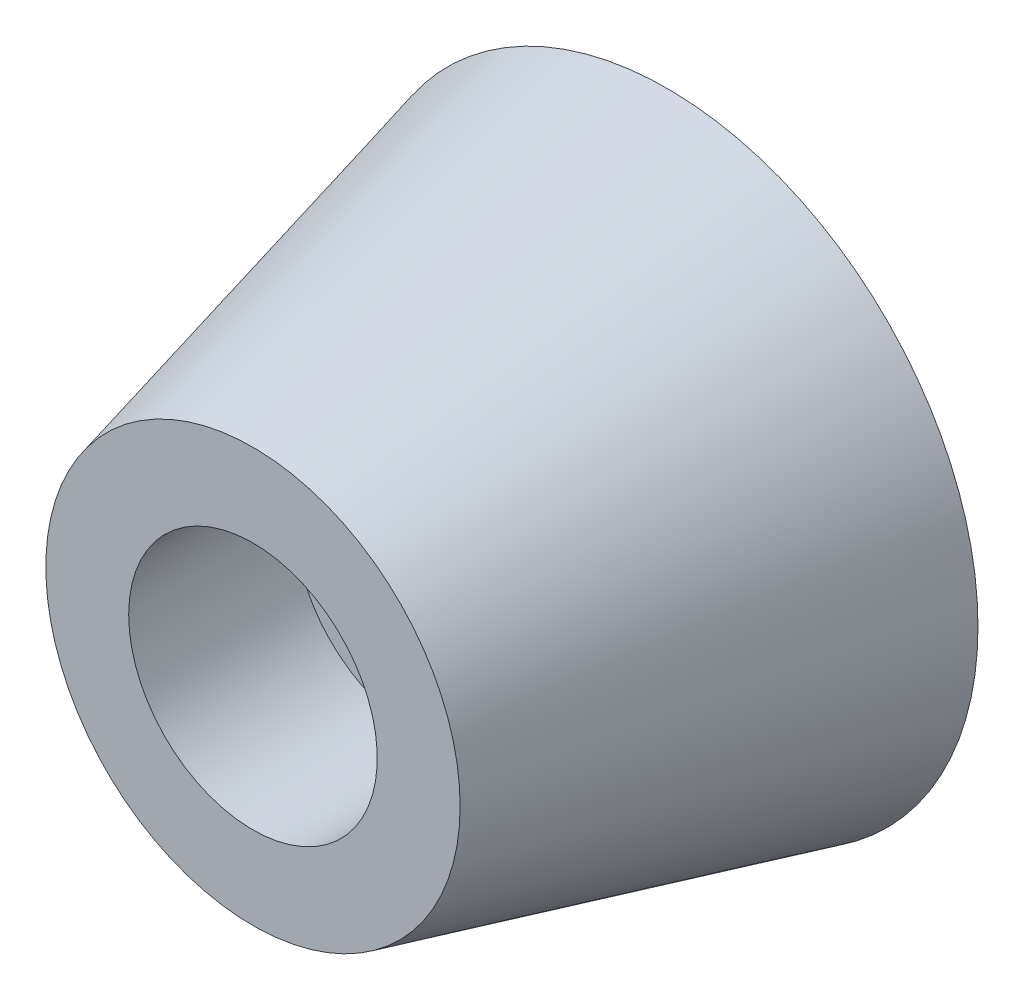
ISO-10303-21;
HEADER;
FILE_DESCRIPTION(('STEP AP214'),'2;1');
FILE_NAME('part.step','',(''),(''),'','','');
FILE_SCHEMA(('AUTOMOTIVE_DESIGN { 1 0 10303 214 1 1 1 1 }'));
ENDSEC;
DATA;
#1=APPLICATION_CONTEXT('core data for automotive mechanical design processes');
#2=APPLICATION_PROTOCOL_DEFINITION('international standard','automotive_design',2000,#1);
#3=PRODUCT_CONTEXT('',#1,'mechanical');
#4=PRODUCT('Part','Part','',(#3));
#5=PRODUCT_RELATED_PRODUCT_CATEGORY('part','',(#4));
#6=PRODUCT_DEFINITION_FORMATION('','',#4);
#7=PRODUCT_DEFINITION_CONTEXT('part definition',#1,'design');
#8=PRODUCT_DEFINITION('design','',#6,#7);
#9=PRODUCT_DEFINITION_SHAPE('','',#8);
#10=(LENGTH_UNIT() NAMED_UNIT(*) SI_UNIT(.MILLI.,.METRE.));
#11=(NAMED_UNIT(*) PLANE_ANGLE_UNIT() SI_UNIT($,.RADIAN.));
#12=(NAMED_UNIT(*) SI_UNIT($,.STERADIAN.) SOLID_ANGLE_UNIT());
#13=UNCERTAINTY_MEASURE_WITH_UNIT(LENGTH_MEASURE(1.E-05),#10,'distance_accuracy_value','');
#14=(GEOMETRIC_REPRESENTATION_CONTEXT(3) GLOBAL_UNCERTAINTY_ASSIGNED_CONTEXT((#13)) GLOBAL_UNIT_ASSIGNED_CONTEXT((#10,
#11,#12)) REPRESENTATION_CONTEXT('',''));
#15=CARTESIAN_POINT('',(0.,0.,0.));
#16=DIRECTION('',(0.,0.,1.));
#17=DIRECTION('',(1.,0.,0.));
#18=AXIS2_PLACEMENT_3D('',#15,#16,#17);
#19=CARTESIAN_POINT('',(0.,0.,10.));
#20=DIRECTION('',(0.,0.,1.));
#21=DIRECTION('',(1.,0.,0.));
#22=AXIS2_PLACEMENT_3D('',#19,#20,#21);
#23=PLANE('',#22);
#24=CARTESIAN_POINT('',(0.,0.,10.));
#25=DIRECTION('',(0.,0.,-1.));
#26=DIRECTION('',(-1.,0.,0.));
#27=AXIS2_PLACEMENT_3D('',#24,#25,#26);
#28=CIRCLE('',#27,3.);
#29=CARTESIAN_POINT('',(-3.,0.,10.));
#30=VERTEX_POINT('',#29);
#31=EDGE_CURVE('E109',#30,#30,#28,.T.);
#32=ORIENTED_EDGE('',*,*,#31,.T.);
#33=EDGE_LOOP('',(#32));
#34=FACE_BOUND('',#33,.T.);
#35=CARTESIAN_POINT('',(0.,0.,10.));
#36=DIRECTION('',(0.,0.,1.));
#37=DIRECTION('',(1.,0.,0.));
#38=AXIS2_PLACEMENT_3D('',#35,#36,#37);
#39=CIRCLE('',#38,5.);
#40=CARTESIAN_POINT('',(5.,0.,10.));
#41=VERTEX_POINT('',#40);
#42=EDGE_CURVE('E11',#41,#41,#39,.T.);
#43=ORIENTED_EDGE('',*,*,#42,.T.);
#44=EDGE_LOOP('',(#43));
#45=FACE_BOUND('',#44,.T.);
#46=ADVANCED_FACE('F39',(#34,#45),#23,.T.);
#47=CARTESIAN_POINT('',(0.,0.,0.));
#48=DIRECTION('',(0.,0.,1.));
#49=DIRECTION('',(1.,0.,0.));
#50=AXIS2_PLACEMENT_3D('',#47,#48,#49);
#51=PLANE('',#50);
#52=CARTESIAN_POINT('',(0.,0.,0.));
#53=DIRECTION('',(0.,0.,1.));
#54=DIRECTION('',(1.,0.,0.));
#55=AXIS2_PLACEMENT_3D('',#52,#53,#54);
#56=CIRCLE('',#55,1.75);
#57=CARTESIAN_POINT('',(1.75,0.,0.));
#58=VERTEX_POINT('',#57);
#59=EDGE_CURVE('E43',#58,#58,#56,.T.);
#60=ORIENTED_EDGE('',*,*,#59,.T.);
#61=EDGE_LOOP('',(#60));
#62=FACE_BOUND('',#61,.T.);
#63=CARTESIAN_POINT('',(0.,0.,0.));
#64=DIRECTION('',(0.,0.,1.));
#65=DIRECTION('',(1.,0.,0.));
#66=AXIS2_PLACEMENT_3D('',#63,#64,#65);
#67=CIRCLE('',#66,7.49855076872682);
#68=CARTESIAN_POINT('',(7.49855076872682,0.,0.));
#69=VERTEX_POINT('',#68);
#70=EDGE_CURVE('E47',#69,#69,#67,.T.);
#71=ORIENTED_EDGE('',*,*,#70,.F.);
#72=EDGE_LOOP('',(#71));
#73=FACE_BOUND('',#72,.T.);
#74=ADVANCED_FACE('F73',(#62,#73),#51,.F.);
#75=CARTESIAN_POINT('',(0.,0.,10.));
#76=DIRECTION('',(0.,0.,-1.));
#77=DIRECTION('',(-1.,0.,0.));
#78=AXIS2_PLACEMENT_3D('',#75,#76,#77);
#79=CONICAL_SURFACE('',#78,5.,0.244842260238956);
#80=ORIENTED_EDGE('',*,*,#70,.T.);
#81=EDGE_LOOP('',(#80));
#82=FACE_BOUND('',#81,.T.);
#83=ORIENTED_EDGE('',*,*,#42,.F.);
#84=EDGE_LOOP('',(#83));
#85=FACE_BOUND('',#84,.T.);
#86=ADVANCED_FACE('F82',(#82,#85),#79,.T.);
#87=CARTESIAN_POINT('',(0.,0.,6.));
#88=DIRECTION('',(0.,0.,1.));
#89=DIRECTION('',(1.,0.,0.));
#90=AXIS2_PLACEMENT_3D('',#87,#88,#89);
#91=CYLINDRICAL_SURFACE('',#90,3.);
#92=CARTESIAN_POINT('',(0.,0.,6.));
#93=DIRECTION('',(0.,0.,-1.));
#94=DIRECTION('',(-1.,0.,0.));
#95=AXIS2_PLACEMENT_3D('',#92,#93,#94);
#96=CIRCLE('',#95,3.);
#97=CARTESIAN_POINT('',(-3.,0.,6.));
#98=VERTEX_POINT('',#97);
#99=EDGE_CURVE('E53',#98,#98,#96,.T.);
#100=ORIENTED_EDGE('',*,*,#99,.T.);
#101=EDGE_LOOP('',(#100));
#102=FACE_BOUND('',#101,.T.);
#103=ORIENTED_EDGE('',*,*,#31,.F.);
#104=EDGE_LOOP('',(#103));
#105=FACE_BOUND('',#104,.T.);
#106=ADVANCED_FACE('F84',(#102,#105),#91,.F.);
#107=CARTESIAN_POINT('',(0.,0.,6.));
#108=DIRECTION('',(0.,0.,-1.));
#109=DIRECTION('',(-1.,0.,0.));
#110=AXIS2_PLACEMENT_3D('',#107,#108,#109);
#111=PLANE('',#110);
#112=CARTESIAN_POINT('',(0.,0.,6.));
#113=DIRECTION('',(0.,0.,1.));
#114=DIRECTION('',(1.,0.,0.));
#115=AXIS2_PLACEMENT_3D('',#112,#113,#114);
#116=CIRCLE('',#115,1.75);
#117=CARTESIAN_POINT('',(1.75,0.,6.));
#118=VERTEX_POINT('',#117);
#119=EDGE_CURVE('E114',#118,#118,#116,.T.);
#120=ORIENTED_EDGE('',*,*,#119,.F.);
#121=EDGE_LOOP('',(#120));
#122=FACE_BOUND('',#121,.T.);
#123=ORIENTED_EDGE('',*,*,#99,.F.);
#124=EDGE_LOOP('',(#123));
#125=FACE_BOUND('',#124,.T.);
#126=ADVANCED_FACE('F124',(#122,#125),#111,.F.);
#127=CARTESIAN_POINT('',(0.,0.,-4.));
#128=DIRECTION('',(0.,0.,1.));
#129=DIRECTION('',(1.,0.,0.));
#130=AXIS2_PLACEMENT_3D('',#127,#128,#129);
#131=CYLINDRICAL_SURFACE('',#130,1.75);
#132=ORIENTED_EDGE('',*,*,#119,.T.);
#133=EDGE_LOOP('',(#132));
#134=FACE_BOUND('',#133,.T.);
#135=ORIENTED_EDGE('',*,*,#59,.F.);
#136=EDGE_LOOP('',(#135));
#137=FACE_BOUND('',#136,.T.);
#138=ADVANCED_FACE('F122',(#134,#137),#131,.F.);
#139=CLOSED_SHELL('',(#46,#74,#86,#106,#126,#138));
#140=MANIFOLD_SOLID_BREP('B2',#139);
#141=ADVANCED_BREP_SHAPE_REPRESENTATION('',(#18,#140),#14);
#142=SHAPE_DEFINITION_REPRESENTATION(#9,#141);
ENDSEC;
END-ISO-10303-21;
